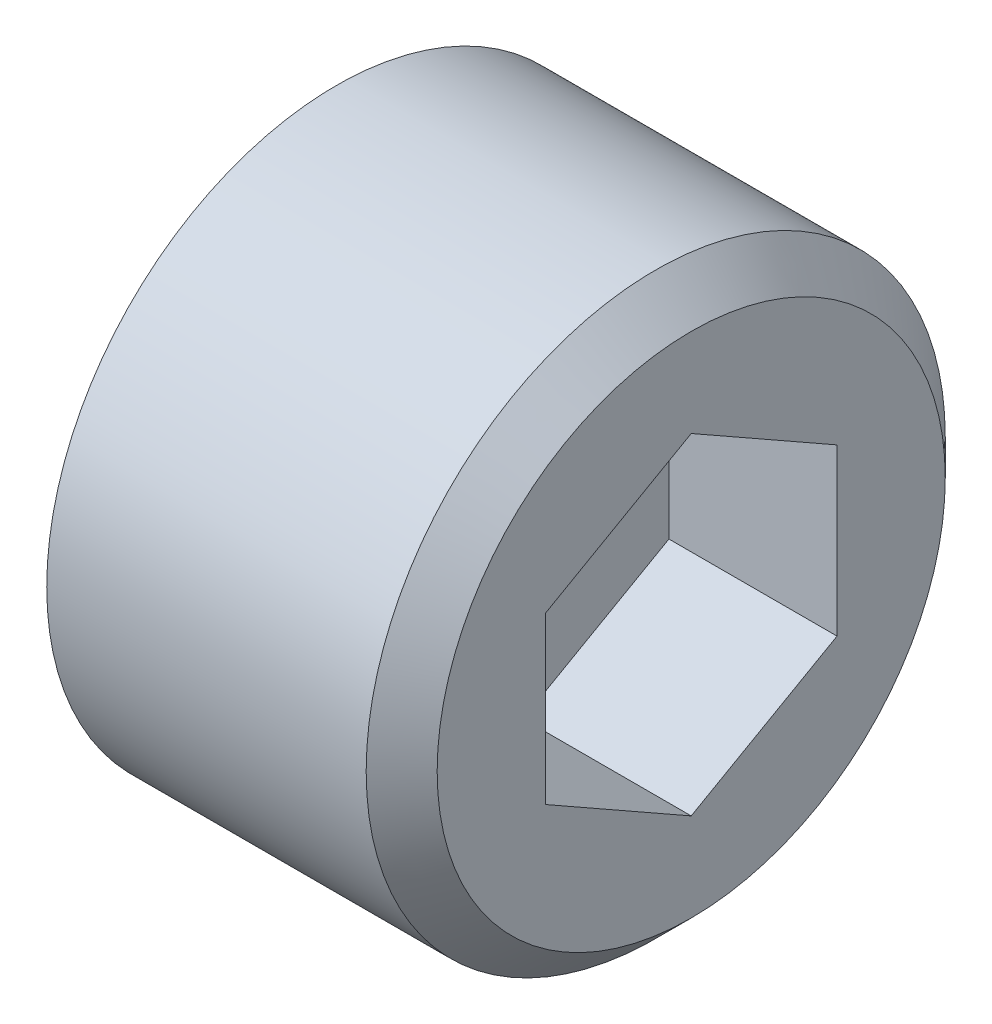
ISO-10303-21;
HEADER;
FILE_DESCRIPTION(('STEP AP214'),'2;1');
FILE_NAME('part.step','',(''),(''),'','','');
FILE_SCHEMA(('AUTOMOTIVE_DESIGN { 1 0 10303 214 1 1 1 1 }'));
ENDSEC;
DATA;
#1=APPLICATION_CONTEXT('core data for automotive mechanical design processes');
#2=APPLICATION_PROTOCOL_DEFINITION('international standard','automotive_design',2000,#1);
#3=PRODUCT_CONTEXT('',#1,'mechanical');
#4=PRODUCT('Part','Part','',(#3));
#5=PRODUCT_RELATED_PRODUCT_CATEGORY('part','',(#4));
#6=PRODUCT_DEFINITION_FORMATION('','',#4);
#7=PRODUCT_DEFINITION_CONTEXT('part definition',#1,'design');
#8=PRODUCT_DEFINITION('design','',#6,#7);
#9=PRODUCT_DEFINITION_SHAPE('','',#8);
#10=(LENGTH_UNIT() NAMED_UNIT(*) SI_UNIT(.MILLI.,.METRE.));
#11=(NAMED_UNIT(*) PLANE_ANGLE_UNIT() SI_UNIT($,.RADIAN.));
#12=(NAMED_UNIT(*) SI_UNIT($,.STERADIAN.) SOLID_ANGLE_UNIT());
#13=UNCERTAINTY_MEASURE_WITH_UNIT(LENGTH_MEASURE(1.E-05),#10,'distance_accuracy_value','');
#14=(GEOMETRIC_REPRESENTATION_CONTEXT(3) GLOBAL_UNCERTAINTY_ASSIGNED_CONTEXT((#13)) GLOBAL_UNIT_ASSIGNED_CONTEXT((#10,
#11,#12)) REPRESENTATION_CONTEXT('',''));
#15=CARTESIAN_POINT('',(0.,0.,0.));
#16=DIRECTION('',(0.,0.,1.));
#17=DIRECTION('',(1.,0.,0.));
#18=AXIS2_PLACEMENT_3D('',#15,#16,#17);
#19=CARTESIAN_POINT('',(698.265305948307,491.9201871,6.22299999999962));
#20=DIRECTION('',(1.,0.,0.));
#21=DIRECTION('',(0.,0.,-1.));
#22=AXIS2_PLACEMENT_3D('',#19,#20,#21);
#23=PLANE('',#22);
#24=DIRECTION('',(0.,0.493693899375207,0.869635747724128));
#25=VECTOR('',#24,1.);
#26=CARTESIAN_POINT('',(698.265305948307,493.045906050237,4.24005987808279));
#27=LINE('',#26,#25);
#28=CARTESIAN_POINT('',(698.265305948307,493.045906050237,4.24005987808279));
#29=VERTEX_POINT('',#28);
#30=CARTESIAN_POINT('',(698.265305948307,494.171625000473,6.22299999999956));
#31=VERTEX_POINT('',#30);
#32=EDGE_CURVE('E81',#29,#31,#27,.T.);
#33=ORIENTED_EDGE('',*,*,#32,.T.);
#34=DIRECTION('',(0.,-0.493693899375212,0.869635747724125));
#35=VECTOR('',#34,1.);
#36=CARTESIAN_POINT('',(698.265305948307,494.171625000473,6.22299999999962));
#37=LINE('',#36,#35);
#38=CARTESIAN_POINT('',(698.265305948307,493.045906050237,8.20594012191634));
#39=VERTEX_POINT('',#38);
#40=EDGE_CURVE('E65',#31,#39,#37,.T.);
#41=ORIENTED_EDGE('',*,*,#40,.T.);
#42=DIRECTION('',(0.,1.,0.));
#43=VECTOR('',#42,1.);
#44=CARTESIAN_POINT('',(698.265305948307,493.045906050237,8.2059401219164));
#45=LINE('',#44,#43);
#46=CARTESIAN_POINT('',(698.265305948307,490.794468149764,8.2059401219164));
#47=VERTEX_POINT('',#46);
#48=EDGE_CURVE('E70',#39,#47,#45,.F.);
#49=ORIENTED_EDGE('',*,*,#48,.T.);
#50=DIRECTION('',(0.,-0.493693899375212,-0.869635747724125));
#51=VECTOR('',#50,1.);
#52=CARTESIAN_POINT('',(698.265305948307,490.794468149764,8.2059401219164));
#53=LINE('',#52,#51);
#54=CARTESIAN_POINT('',(698.265305948307,489.668749199525,6.22299999999941));
#55=VERTEX_POINT('',#54);
#56=EDGE_CURVE('E104',#47,#55,#53,.T.);
#57=ORIENTED_EDGE('',*,*,#56,.T.);
#58=DIRECTION('',(0.,0.493693899375192,-0.869635747724136));
#59=VECTOR('',#58,1.);
#60=CARTESIAN_POINT('',(698.265305948307,489.668749199524,6.22299999999962));
#61=LINE('',#60,#59);
#62=CARTESIAN_POINT('',(698.265305948307,490.794468149763,4.24005987808258));
#63=VERTEX_POINT('',#62);
#64=EDGE_CURVE('E99',#55,#63,#61,.T.);
#65=ORIENTED_EDGE('',*,*,#64,.T.);
#66=DIRECTION('',(0.,1.,0.));
#67=VECTOR('',#66,1.);
#68=CARTESIAN_POINT('',(698.265305948307,490.794468149764,4.24005987808279));
#69=LINE('',#68,#67);
#70=EDGE_CURVE('E95',#63,#29,#69,.T.);
#71=ORIENTED_EDGE('',*,*,#70,.T.);
#72=EDGE_LOOP('',(#33,#41,#49,#57,#65,#71));
#73=FACE_BOUND('',#72,.T.);
#74=ADVANCED_FACE('F16',(#73),#23,.T.);
#75=CARTESIAN_POINT('',(700.551305948307,493.045906050237,8.2059401219164));
#76=DIRECTION('',(0.,0.,1.));
#77=DIRECTION('',(1.,0.,0.));
#78=AXIS2_PLACEMENT_3D('',#75,#76,#77);
#79=PLANE('',#78);
#80=DIRECTION('',(1.,0.,0.));
#81=VECTOR('',#80,1.);
#82=CARTESIAN_POINT('',(700.551305948307,493.045906050236,8.20594012191616));
#83=LINE('',#82,#81);
#84=CARTESIAN_POINT('',(700.551305948307,493.045906050237,8.20594012191634));
#85=VERTEX_POINT('',#84);
#86=EDGE_CURVE('E72',#39,#85,#83,.T.);
#87=ORIENTED_EDGE('',*,*,#86,.T.);
#88=DIRECTION('',(0.,1.,0.));
#89=VECTOR('',#88,1.);
#90=CARTESIAN_POINT('',(700.551305948307,491.9201871,8.2059401219164));
#91=LINE('',#90,#89);
#92=CARTESIAN_POINT('',(700.551305948307,490.794468149764,8.2059401219164));
#93=VERTEX_POINT('',#92);
#94=EDGE_CURVE('E106',#93,#85,#91,.T.);
#95=ORIENTED_EDGE('',*,*,#94,.F.);
#96=DIRECTION('',(1.,0.,0.));
#97=VECTOR('',#96,1.);
#98=CARTESIAN_POINT('',(700.551305948307,490.794468149764,8.2059401219164));
#99=LINE('',#98,#97);
#100=EDGE_CURVE('E75',#93,#47,#99,.F.);
#101=ORIENTED_EDGE('',*,*,#100,.T.);
#102=ORIENTED_EDGE('',*,*,#48,.F.);
#103=EDGE_LOOP('',(#87,#95,#101,#102));
#104=FACE_BOUND('',#103,.T.);
#105=ADVANCED_FACE('F71',(#104),#79,.F.);
#106=CARTESIAN_POINT('',(700.551305948307,494.171625000473,6.22299999999962));
#107=DIRECTION('',(0.,0.869635747724125,0.493693899375212));
#108=DIRECTION('',(0.,-0.493693899375212,0.869635747724125));
#109=AXIS2_PLACEMENT_3D('',#106,#107,#108);
#110=PLANE('',#109);
#111=DIRECTION('',(1.,0.,0.));
#112=VECTOR('',#111,1.);
#113=CARTESIAN_POINT('',(700.551305948307,494.171625000474,6.22299999999939));
#114=LINE('',#113,#112);
#115=CARTESIAN_POINT('',(700.551305948307,494.171625000473,6.22299999999956));
#116=VERTEX_POINT('',#115);
#117=EDGE_CURVE('E83',#31,#116,#114,.T.);
#118=ORIENTED_EDGE('',*,*,#117,.T.);
#119=DIRECTION('',(0.,0.493693899375033,-0.869635747724227));
#120=VECTOR('',#119,1.);
#121=CARTESIAN_POINT('',(700.551305948307,493.045906050237,8.2059401219164));
#122=LINE('',#121,#120);
#123=EDGE_CURVE('E87',#85,#116,#122,.T.);
#124=ORIENTED_EDGE('',*,*,#123,.F.);
#125=ORIENTED_EDGE('',*,*,#86,.F.);
#126=ORIENTED_EDGE('',*,*,#40,.F.);
#127=EDGE_LOOP('',(#118,#124,#125,#126));
#128=FACE_BOUND('',#127,.T.);
#129=ADVANCED_FACE('F85',(#128),#110,.F.);
#130=CARTESIAN_POINT('',(700.551305948307,493.045906050237,4.24005987808279));
#131=DIRECTION('',(0.,0.869635747724128,-0.493693899375207));
#132=DIRECTION('',(0.,0.493693899375207,0.869635747724128));
#133=AXIS2_PLACEMENT_3D('',#130,#131,#132);
#134=PLANE('',#133);
#135=DIRECTION('',(-1.,0.,0.));
#136=VECTOR('',#135,1.);
#137=CARTESIAN_POINT('',(700.551305948307,493.045906050237,4.24005987808279));
#138=LINE('',#137,#136);
#139=CARTESIAN_POINT('',(700.551305948307,493.045906050237,4.24005987808279));
#140=VERTEX_POINT('',#139);
#141=EDGE_CURVE('E93',#29,#140,#138,.F.);
#142=ORIENTED_EDGE('',*,*,#141,.T.);
#143=DIRECTION('',(0.,-0.493693899375023,-0.869635747724232));
#144=VECTOR('',#143,1.);
#145=CARTESIAN_POINT('',(700.551305948307,494.171625000473,6.22299999999962));
#146=LINE('',#145,#144);
#147=EDGE_CURVE('E109',#116,#140,#146,.T.);
#148=ORIENTED_EDGE('',*,*,#147,.F.);
#149=ORIENTED_EDGE('',*,*,#117,.F.);
#150=ORIENTED_EDGE('',*,*,#32,.F.);
#151=EDGE_LOOP('',(#142,#148,#149,#150));
#152=FACE_BOUND('',#151,.T.);
#153=ADVANCED_FACE('F191',(#152),#134,.F.);
#154=CARTESIAN_POINT('',(700.551305948307,490.794468149764,4.24005987808279));
#155=DIRECTION('',(0.,0.,-1.));
#156=DIRECTION('',(-1.,0.,0.));
#157=AXIS2_PLACEMENT_3D('',#154,#155,#156);
#158=PLANE('',#157);
#159=DIRECTION('',(1.,0.,0.));
#160=VECTOR('',#159,1.);
#161=CARTESIAN_POINT('',(700.551305948307,490.794468149762,4.24005987808193));
#162=LINE('',#161,#160);
#163=CARTESIAN_POINT('',(700.551305948307,490.794468149763,4.24005987808258));
#164=VERTEX_POINT('',#163);
#165=EDGE_CURVE('E97',#63,#164,#162,.T.);
#166=ORIENTED_EDGE('',*,*,#165,.T.);
#167=DIRECTION('',(0.,1.,0.));
#168=VECTOR('',#167,1.);
#169=CARTESIAN_POINT('',(700.551305948307,491.9201871,4.24005987808279));
#170=LINE('',#169,#168);
#171=EDGE_CURVE('E112',#140,#164,#170,.F.);
#172=ORIENTED_EDGE('',*,*,#171,.F.);
#173=ORIENTED_EDGE('',*,*,#141,.F.);
#174=ORIENTED_EDGE('',*,*,#70,.F.);
#175=EDGE_LOOP('',(#166,#172,#173,#174));
#176=FACE_BOUND('',#175,.T.);
#177=ADVANCED_FACE('F138',(#176),#158,.F.);
#178=CARTESIAN_POINT('',(700.551305948307,489.668749199524,6.22299999999962));
#179=DIRECTION('',(0.,-0.869635747724136,-0.493693899375192));
#180=DIRECTION('',(0.,0.493693899375192,-0.869635747724136));
#181=AXIS2_PLACEMENT_3D('',#178,#179,#180);
#182=PLANE('',#181);
#183=DIRECTION('',(1.,0.,0.));
#184=VECTOR('',#183,1.);
#185=CARTESIAN_POINT('',(700.551305948307,489.668749199526,6.22299999999879));
#186=LINE('',#185,#184);
#187=CARTESIAN_POINT('',(700.551305948307,489.668749199525,6.22299999999941));
#188=VERTEX_POINT('',#187);
#189=EDGE_CURVE('E33',#55,#188,#186,.T.);
#190=ORIENTED_EDGE('',*,*,#189,.T.);
#191=DIRECTION('',(0.,-0.493693899375852,0.869635747723762));
#192=VECTOR('',#191,1.);
#193=CARTESIAN_POINT('',(700.551305948307,490.794468149764,4.24005987808279));
#194=LINE('',#193,#192);
#195=EDGE_CURVE('E115',#164,#188,#194,.T.);
#196=ORIENTED_EDGE('',*,*,#195,.F.);
#197=ORIENTED_EDGE('',*,*,#165,.F.);
#198=ORIENTED_EDGE('',*,*,#64,.F.);
#199=EDGE_LOOP('',(#190,#196,#197,#198));
#200=FACE_BOUND('',#199,.T.);
#201=ADVANCED_FACE('F136',(#200),#182,.F.);
#202=CARTESIAN_POINT('',(700.551305948307,490.794468149764,8.2059401219164));
#203=DIRECTION('',(0.,-0.869635747724125,0.493693899375212));
#204=DIRECTION('',(0.,-0.493693899375212,-0.869635747724125));
#205=AXIS2_PLACEMENT_3D('',#202,#203,#204);
#206=PLANE('',#205);
#207=ORIENTED_EDGE('',*,*,#100,.F.);
#208=DIRECTION('',(0.,0.493693899375861,0.869635747723757));
#209=VECTOR('',#208,1.);
#210=CARTESIAN_POINT('',(700.551305948307,489.668749199524,6.22299999999962));
#211=LINE('',#210,#209);
#212=EDGE_CURVE('E118',#188,#93,#211,.T.);
#213=ORIENTED_EDGE('',*,*,#212,.F.);
#214=ORIENTED_EDGE('',*,*,#189,.F.);
#215=ORIENTED_EDGE('',*,*,#56,.F.);
#216=EDGE_LOOP('',(#207,#213,#214,#215));
#217=FACE_BOUND('',#216,.T.);
#218=ADVANCED_FACE('F132',(#217),#206,.F.);
#219=CARTESIAN_POINT('',(700.551305948307,491.9201871,6.22299999999959));
#220=DIRECTION('',(1.,0.,0.));
#221=DIRECTION('',(0.,0.,-1.));
#222=AXIS2_PLACEMENT_3D('',#219,#220,#221);
#223=PLANE('',#222);
#224=CARTESIAN_POINT('',(700.551305948295,491.9201871,6.22299999999959));
#225=DIRECTION('',(-1.,0.,0.));
#226=DIRECTION('',(0.,0.,1.));
#227=AXIS2_PLACEMENT_3D('',#224,#225,#226);
#228=CIRCLE('',#227,3.45440000001696);
#229=CARTESIAN_POINT('',(700.551305948295,491.9201871,9.67740000001655));
#230=VERTEX_POINT('',#229);
#231=EDGE_CURVE('E19',#230,#230,#228,.T.);
#232=ORIENTED_EDGE('',*,*,#231,.F.);
#233=EDGE_LOOP('',(#232));
#234=FACE_BOUND('',#233,.T.);
#235=ORIENTED_EDGE('',*,*,#195,.T.);
#236=ORIENTED_EDGE('',*,*,#212,.T.);
#237=ORIENTED_EDGE('',*,*,#94,.T.);
#238=ORIENTED_EDGE('',*,*,#123,.T.);
#239=ORIENTED_EDGE('',*,*,#147,.T.);
#240=ORIENTED_EDGE('',*,*,#171,.T.);
#241=EDGE_LOOP('',(#235,#236,#237,#238,#239,#240));
#242=FACE_BOUND('',#241,.T.);
#243=ADVANCED_FACE('F129',(#234,#242),#223,.T.);
#244=CARTESIAN_POINT('',(700.068705948411,491.9201871,6.22299999999959));
#245=DIRECTION('',(-1.,0.,0.));
#246=DIRECTION('',(0.,0.,1.));
#247=AXIS2_PLACEMENT_3D('',#244,#245,#246);
#248=CONICAL_SURFACE('',#247,3.93699999990127,0.785398163397448);
#249=CARTESIAN_POINT('',(700.068705948307,491.9201871,6.22299999999959));
#250=DIRECTION('',(1.,0.,0.));
#251=DIRECTION('',(0.,0.,-1.));
#252=AXIS2_PLACEMENT_3D('',#249,#250,#251);
#253=CIRCLE('',#252,3.937);
#254=CARTESIAN_POINT('',(700.068705948307,491.9201871,2.28599999999959));
#255=VERTEX_POINT('',#254);
#256=EDGE_CURVE('E25',#255,#255,#253,.F.);
#257=ORIENTED_EDGE('',*,*,#256,.F.);
#258=EDGE_LOOP('',(#257));
#259=FACE_BOUND('',#258,.T.);
#260=ORIENTED_EDGE('',*,*,#231,.T.);
#261=EDGE_LOOP('',(#260));
#262=FACE_BOUND('',#261,.T.);
#263=ADVANCED_FACE('F127',(#259,#262),#248,.T.);
#264=CARTESIAN_POINT('',(695.725305948307,491.9201871,6.22299999999959));
#265=DIRECTION('',(1.,0.,0.));
#266=DIRECTION('',(0.,0.,-1.));
#267=AXIS2_PLACEMENT_3D('',#264,#265,#266);
#268=PLANE('',#267);
#269=CARTESIAN_POINT('',(695.725305948307,491.9201871,6.22299999999959));
#270=DIRECTION('',(1.,0.,0.));
#271=DIRECTION('',(0.,0.,-1.));
#272=AXIS2_PLACEMENT_3D('',#269,#270,#271);
#273=CIRCLE('',#272,3.937);
#274=CARTESIAN_POINT('',(695.725305948307,491.9201871,2.28599999999959));
#275=VERTEX_POINT('',#274);
#276=EDGE_CURVE('E11',#275,#275,#273,.T.);
#277=ORIENTED_EDGE('',*,*,#276,.F.);
#278=EDGE_LOOP('',(#277));
#279=FACE_BOUND('',#278,.T.);
#280=ADVANCED_FACE('F150',(#279),#268,.F.);
#281=CARTESIAN_POINT('',(700.551305948307,491.9201871,6.22299999999959));
#282=DIRECTION('',(1.,0.,0.));
#283=DIRECTION('',(0.,0.,-1.));
#284=AXIS2_PLACEMENT_3D('',#281,#282,#283);
#285=CYLINDRICAL_SURFACE('',#284,3.937);
#286=ORIENTED_EDGE('',*,*,#256,.T.);
#287=EDGE_LOOP('',(#286));
#288=FACE_BOUND('',#287,.T.);
#289=ORIENTED_EDGE('',*,*,#276,.T.);
#290=EDGE_LOOP('',(#289));
#291=FACE_BOUND('',#290,.T.);
#292=ADVANCED_FACE('F148',(#288,#291),#285,.T.);
#293=CLOSED_SHELL('',(#74,#105,#129,#153,#177,#201,#218,#243,#263,#280,#292));
#294=MANIFOLD_SOLID_BREP('B1',#293);
#295=ADVANCED_BREP_SHAPE_REPRESENTATION('',(#18,#294),#14);
#296=SHAPE_DEFINITION_REPRESENTATION(#9,#295);
ENDSEC;
END-ISO-10303-21;
